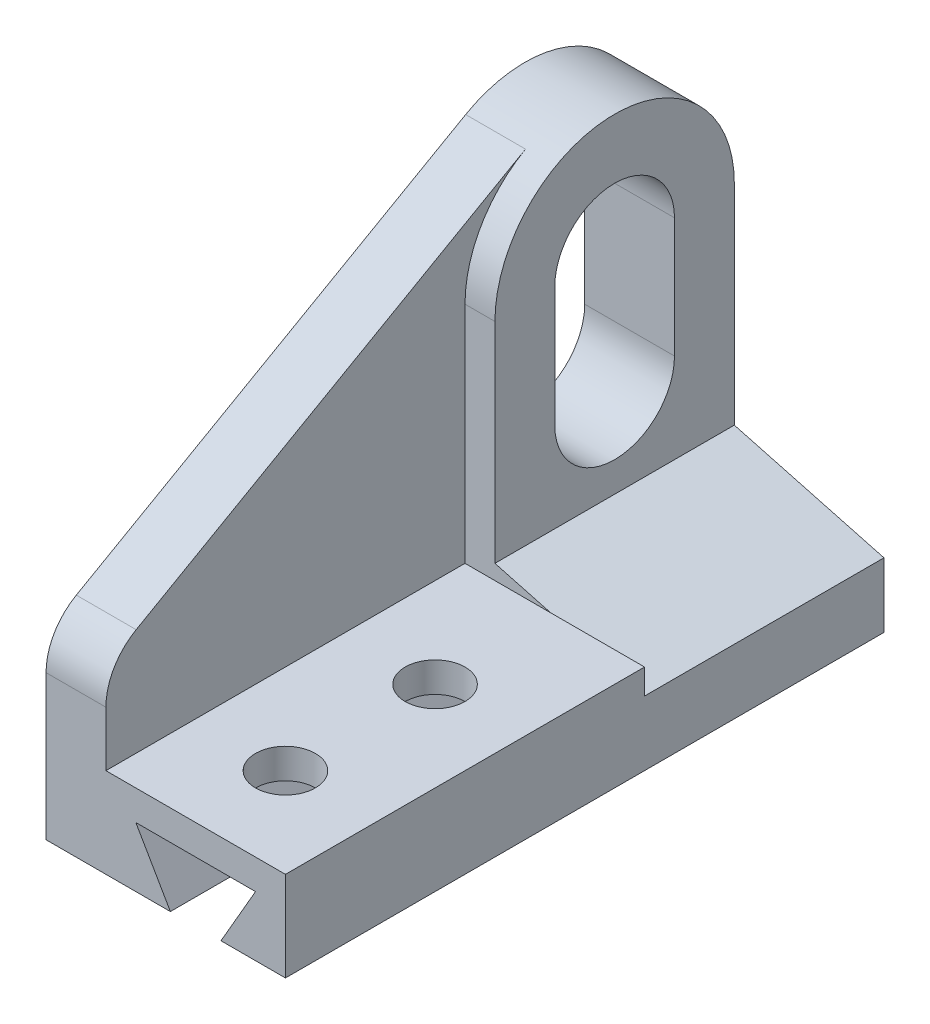
ISO-10303-21;
HEADER;
FILE_DESCRIPTION(('STEP AP214'),'2;1');
FILE_NAME('part.step','',(''),(''),'','','');
FILE_SCHEMA(('AUTOMOTIVE_DESIGN { 1 0 10303 214 1 1 1 1 }'));
ENDSEC;
DATA;
#1=APPLICATION_CONTEXT('core data for automotive mechanical design processes');
#2=APPLICATION_PROTOCOL_DEFINITION('international standard','automotive_design',2000,#1);
#3=PRODUCT_CONTEXT('',#1,'mechanical');
#4=PRODUCT('Part','Part','',(#3));
#5=PRODUCT_RELATED_PRODUCT_CATEGORY('part','',(#4));
#6=PRODUCT_DEFINITION_FORMATION('','',#4);
#7=PRODUCT_DEFINITION_CONTEXT('part definition',#1,'design');
#8=PRODUCT_DEFINITION('design','',#6,#7);
#9=PRODUCT_DEFINITION_SHAPE('','',#8);
#10=(LENGTH_UNIT() NAMED_UNIT(*) SI_UNIT(.MILLI.,.METRE.));
#11=(NAMED_UNIT(*) PLANE_ANGLE_UNIT() SI_UNIT($,.RADIAN.));
#12=(NAMED_UNIT(*) SI_UNIT($,.STERADIAN.) SOLID_ANGLE_UNIT());
#13=UNCERTAINTY_MEASURE_WITH_UNIT(LENGTH_MEASURE(1.E-05),#10,'distance_accuracy_value','');
#14=(GEOMETRIC_REPRESENTATION_CONTEXT(3) GLOBAL_UNCERTAINTY_ASSIGNED_CONTEXT((#13)) GLOBAL_UNIT_ASSIGNED_CONTEXT((#10,
#11,#12)) REPRESENTATION_CONTEXT('',''));
#15=CARTESIAN_POINT('',(0.,0.,0.));
#16=DIRECTION('',(0.,0.,1.));
#17=DIRECTION('',(1.,0.,0.));
#18=AXIS2_PLACEMENT_3D('',#15,#16,#17);
#19=CARTESIAN_POINT('',(12.7,0.,0.));
#20=DIRECTION('',(0.,0.,1.));
#21=DIRECTION('',(1.,0.,0.));
#22=AXIS2_PLACEMENT_3D('',#19,#20,#21);
#23=PLANE('',#22);
#24=DIRECTION('',(-1.,0.,0.));
#25=VECTOR('',#24,1.);
#26=CARTESIAN_POINT('',(44.45,12.7,0.));
#27=LINE('',#26,#25);
#28=CARTESIAN_POINT('',(44.45,12.7,0.));
#29=VERTEX_POINT('',#28);
#30=CARTESIAN_POINT('',(19.05,12.7,0.));
#31=VERTEX_POINT('',#30);
#32=EDGE_CURVE('E245',#29,#31,#27,.T.);
#33=ORIENTED_EDGE('',*,*,#32,.F.);
#34=DIRECTION('',(0.500000000000004,0.866025403784436,0.));
#35=VECTOR('',#34,1.);
#36=CARTESIAN_POINT('',(37.1176515812917,0.,0.));
#37=LINE('',#36,#35);
#38=CARTESIAN_POINT('',(37.1176515812917,0.,0.));
#39=VERTEX_POINT('',#38);
#40=EDGE_CURVE('E240',#39,#29,#37,.T.);
#41=ORIENTED_EDGE('',*,*,#40,.F.);
#42=DIRECTION('',(-1.,0.,0.));
#43=VECTOR('',#42,1.);
#44=CARTESIAN_POINT('',(12.7,0.,0.));
#45=LINE('',#44,#43);
#46=CARTESIAN_POINT('',(50.8,0.,0.));
#47=VERTEX_POINT('',#46);
#48=EDGE_CURVE('E365',#47,#39,#45,.T.);
#49=ORIENTED_EDGE('',*,*,#48,.F.);
#50=DIRECTION('',(0.,1.,0.));
#51=VECTOR('',#50,1.);
#52=CARTESIAN_POINT('',(50.8,0.,0.));
#53=LINE('',#52,#51);
#54=CARTESIAN_POINT('',(50.8,19.05,0.));
#55=VERTEX_POINT('',#54);
#56=EDGE_CURVE('E294',#47,#55,#53,.T.);
#57=ORIENTED_EDGE('',*,*,#56,.T.);
#58=DIRECTION('',(-1.,0.,0.));
#59=VECTOR('',#58,1.);
#60=CARTESIAN_POINT('',(50.8,19.05,0.));
#61=LINE('',#60,#59);
#62=CARTESIAN_POINT('',(12.7,19.05,0.));
#63=VERTEX_POINT('',#62);
#64=EDGE_CURVE('E300',#55,#63,#61,.T.);
#65=ORIENTED_EDGE('',*,*,#64,.T.);
#66=DIRECTION('',(0.,1.,0.));
#67=VECTOR('',#66,1.);
#68=CARTESIAN_POINT('',(12.7,0.,0.));
#69=LINE('',#68,#67);
#70=CARTESIAN_POINT('',(12.7,30.7135112138874,0.));
#71=VERTEX_POINT('',#70);
#72=EDGE_CURVE('E319',#63,#71,#69,.T.);
#73=ORIENTED_EDGE('',*,*,#72,.T.);
#74=DIRECTION('',(-1.,0.,0.));
#75=VECTOR('',#74,1.);
#76=CARTESIAN_POINT('',(12.7,30.7135112138874,0.));
#77=LINE('',#76,#75);
#78=CARTESIAN_POINT('',(0.,30.7135112138874,0.));
#79=VERTEX_POINT('',#78);
#80=EDGE_CURVE('E368',#71,#79,#77,.T.);
#81=ORIENTED_EDGE('',*,*,#80,.T.);
#82=DIRECTION('',(0.,1.,0.));
#83=VECTOR('',#82,1.);
#84=CARTESIAN_POINT('',(0.,0.,0.));
#85=LINE('',#84,#83);
#86=CARTESIAN_POINT('',(0.,0.,0.));
#87=VERTEX_POINT('',#86);
#88=EDGE_CURVE('E330',#87,#79,#85,.T.);
#89=ORIENTED_EDGE('',*,*,#88,.F.);
#90=CARTESIAN_POINT('',(26.3823484187083,0.,0.));
#91=VERTEX_POINT('',#90);
#92=EDGE_CURVE('E364',#91,#87,#45,.T.);
#93=ORIENTED_EDGE('',*,*,#92,.F.);
#94=DIRECTION('',(0.500000000000004,-0.866025403784436,0.));
#95=VECTOR('',#94,1.);
#96=CARTESIAN_POINT('',(19.05,12.7,0.));
#97=LINE('',#96,#95);
#98=EDGE_CURVE('E250',#31,#91,#97,.T.);
#99=ORIENTED_EDGE('',*,*,#98,.F.);
#100=EDGE_LOOP('',(#33,#41,#49,#57,#65,#73,#81,#89,#93,#99));
#101=FACE_BOUND('',#100,.T.);
#102=ADVANCED_FACE('F35',(#101),#23,.T.);
#103=CARTESIAN_POINT('',(12.7,0.,0.));
#104=DIRECTION('',(0.,1.,0.));
#105=DIRECTION('',(0.,0.,1.));
#106=AXIS2_PLACEMENT_3D('',#103,#104,#105);
#107=PLANE('',#106);
#108=DIRECTION('',(0.,0.,-1.));
#109=VECTOR('',#108,1.);
#110=CARTESIAN_POINT('',(37.1176515812917,0.,0.));
#111=LINE('',#110,#109);
#112=CARTESIAN_POINT('',(37.1176515812917,0.,-22.4427594229266));
#113=VERTEX_POINT('',#112);
#114=CARTESIAN_POINT('',(37.1176515812917,0.,-47.4072405770734));
#115=VERTEX_POINT('',#114);
#116=EDGE_CURVE('E264',#113,#115,#111,.T.);
#117=ORIENTED_EDGE('',*,*,#116,.T.);
#118=CARTESIAN_POINT('',(31.75,0.,-50.8));
#119=DIRECTION('',(0.,1.,0.));
#120=DIRECTION('',(0.,0.,1.));
#121=AXIS2_PLACEMENT_3D('',#118,#119,#120);
#122=CIRCLE('',#121,6.35);
#123=CARTESIAN_POINT('',(37.1176515812917,0.,-54.1927594229266));
#124=VERTEX_POINT('',#123);
#125=EDGE_CURVE('E49',#115,#124,#122,.T.);
#126=ORIENTED_EDGE('',*,*,#125,.T.);
#127=CARTESIAN_POINT('',(37.1176515812917,0.,-127.));
#128=VERTEX_POINT('',#127);
#129=EDGE_CURVE('E248',#124,#128,#111,.T.);
#130=ORIENTED_EDGE('',*,*,#129,.T.);
#131=DIRECTION('',(-1.,0.,0.));
#132=VECTOR('',#131,1.);
#133=CARTESIAN_POINT('',(12.7,0.,-127.));
#134=LINE('',#133,#132);
#135=CARTESIAN_POINT('',(50.8,0.,-127.));
#136=VERTEX_POINT('',#135);
#137=EDGE_CURVE('E361',#136,#128,#134,.T.);
#138=ORIENTED_EDGE('',*,*,#137,.F.);
#139=DIRECTION('',(0.,0.,-1.));
#140=VECTOR('',#139,1.);
#141=CARTESIAN_POINT('',(50.8,0.,0.));
#142=LINE('',#141,#140);
#143=EDGE_CURVE('E297',#47,#136,#142,.T.);
#144=ORIENTED_EDGE('',*,*,#143,.F.);
#145=ORIENTED_EDGE('',*,*,#48,.T.);
#146=CARTESIAN_POINT('',(37.1176515812917,0.,-15.6572405770734));
#147=VERTEX_POINT('',#146);
#148=EDGE_CURVE('E244',#39,#147,#111,.T.);
#149=ORIENTED_EDGE('',*,*,#148,.T.);
#150=CARTESIAN_POINT('',(31.75,0.,-19.05));
#151=DIRECTION('',(0.,1.,0.));
#152=DIRECTION('',(0.,0.,1.));
#153=AXIS2_PLACEMENT_3D('',#150,#151,#152);
#154=CIRCLE('',#153,6.35);
#155=EDGE_CURVE('E228',#147,#113,#154,.T.);
#156=ORIENTED_EDGE('',*,*,#155,.T.);
#157=EDGE_LOOP('',(#117,#126,#130,#138,#144,#145,#149,#156));
#158=FACE_BOUND('',#157,.T.);
#159=ADVANCED_FACE('F426',(#158),#107,.F.);
#160=DIRECTION('',(0.,0.,-1.));
#161=VECTOR('',#160,1.);
#162=CARTESIAN_POINT('',(26.3823484187083,0.,0.));
#163=LINE('',#162,#161);
#164=CARTESIAN_POINT('',(26.3823484187083,0.,-54.1927594229266));
#165=VERTEX_POINT('',#164);
#166=CARTESIAN_POINT('',(26.3823484187083,0.,-127.));
#167=VERTEX_POINT('',#166);
#168=EDGE_CURVE('E253',#165,#167,#163,.T.);
#169=ORIENTED_EDGE('',*,*,#168,.F.);
#170=CARTESIAN_POINT('',(26.3823484187083,0.,-47.4072405770734));
#171=VERTEX_POINT('',#170);
#172=EDGE_CURVE('E56',#165,#171,#122,.T.);
#173=ORIENTED_EDGE('',*,*,#172,.T.);
#174=CARTESIAN_POINT('',(26.3823484187083,0.,-22.4427594229266));
#175=VERTEX_POINT('',#174);
#176=EDGE_CURVE('E257',#175,#171,#163,.T.);
#177=ORIENTED_EDGE('',*,*,#176,.F.);
#178=CARTESIAN_POINT('',(26.3823484187083,0.,-15.6572405770734));
#179=VERTEX_POINT('',#178);
#180=EDGE_CURVE('E232',#175,#179,#154,.T.);
#181=ORIENTED_EDGE('',*,*,#180,.T.);
#182=EDGE_CURVE('E254',#91,#179,#163,.T.);
#183=ORIENTED_EDGE('',*,*,#182,.F.);
#184=ORIENTED_EDGE('',*,*,#92,.T.);
#185=DIRECTION('',(0.,0.,-1.));
#186=VECTOR('',#185,1.);
#187=CARTESIAN_POINT('',(0.,0.,0.));
#188=LINE('',#187,#186);
#189=CARTESIAN_POINT('',(0.,0.,-127.));
#190=VERTEX_POINT('',#189);
#191=EDGE_CURVE('E332',#87,#190,#188,.T.);
#192=ORIENTED_EDGE('',*,*,#191,.T.);
#193=EDGE_CURVE('E360',#167,#190,#134,.T.);
#194=ORIENTED_EDGE('',*,*,#193,.F.);
#195=EDGE_LOOP('',(#169,#173,#177,#181,#183,#184,#192,#194));
#196=FACE_BOUND('',#195,.T.);
#197=ADVANCED_FACE('F389',(#196),#107,.F.);
#198=CARTESIAN_POINT('',(12.7,0.,-127.));
#199=DIRECTION('',(0.,0.,1.));
#200=DIRECTION('',(1.,0.,0.));
#201=AXIS2_PLACEMENT_3D('',#198,#199,#200);
#202=PLANE('',#201);
#203=DIRECTION('',(0.,1.,0.));
#204=VECTOR('',#203,1.);
#205=CARTESIAN_POINT('',(19.05,0.,-127.));
#206=LINE('',#205,#204);
#207=CARTESIAN_POINT('',(19.05,22.225,-127.));
#208=VERTEX_POINT('',#207);
#209=CARTESIAN_POINT('',(19.05,66.675,-127.));
#210=VERTEX_POINT('',#209);
#211=EDGE_CURVE('E276',#208,#210,#206,.T.);
#212=ORIENTED_EDGE('',*,*,#211,.F.);
#213=DIRECTION('',(-0.965925826289067,0.258819045102525,0.));
#214=VECTOR('',#213,1.);
#215=CARTESIAN_POINT('',(19.05,22.225,-127.));
#216=LINE('',#215,#214);
#217=CARTESIAN_POINT('',(50.8,13.7176131403117,-127.));
#218=VERTEX_POINT('',#217);
#219=EDGE_CURVE('E220',#218,#208,#216,.T.);
#220=ORIENTED_EDGE('',*,*,#219,.F.);
#221=DIRECTION('',(0.,1.,0.));
#222=VECTOR('',#221,1.);
#223=CARTESIAN_POINT('',(50.8,0.,-127.));
#224=LINE('',#223,#222);
#225=EDGE_CURVE('E213',#136,#218,#224,.T.);
#226=ORIENTED_EDGE('',*,*,#225,.F.);
#227=ORIENTED_EDGE('',*,*,#137,.T.);
#228=DIRECTION('',(-0.500000000000004,-0.866025403784436,0.));
#229=VECTOR('',#228,1.);
#230=CARTESIAN_POINT('',(31.0132386859687,-10.573153285078,-127.));
#231=LINE('',#230,#229);
#232=CARTESIAN_POINT('',(44.45,12.7,-127.));
#233=VERTEX_POINT('',#232);
#234=EDGE_CURVE('E379',#233,#128,#231,.T.);
#235=ORIENTED_EDGE('',*,*,#234,.F.);
#236=DIRECTION('',(1.,0.,0.));
#237=VECTOR('',#236,1.);
#238=CARTESIAN_POINT('',(12.7,12.7,-127.));
#239=LINE('',#238,#237);
#240=CARTESIAN_POINT('',(19.05,12.7,-127.));
#241=VERTEX_POINT('',#240);
#242=EDGE_CURVE('E376',#241,#233,#239,.T.);
#243=ORIENTED_EDGE('',*,*,#242,.F.);
#244=DIRECTION('',(-0.500000000000004,0.866025403784436,0.));
#245=VECTOR('',#244,1.);
#246=CARTESIAN_POINT('',(22.9617613140312,5.92463065701566,-127.));
#247=LINE('',#246,#245);
#248=EDGE_CURVE('E357',#167,#241,#247,.T.);
#249=ORIENTED_EDGE('',*,*,#248,.F.);
#250=ORIENTED_EDGE('',*,*,#193,.T.);
#251=DIRECTION('',(0.,1.,0.));
#252=VECTOR('',#251,1.);
#253=CARTESIAN_POINT('',(0.,0.,-127.));
#254=LINE('',#253,#252);
#255=CARTESIAN_POINT('',(0.,66.675,-127.));
#256=VERTEX_POINT('',#255);
#257=EDGE_CURVE('E335',#190,#256,#254,.T.);
#258=ORIENTED_EDGE('',*,*,#257,.T.);
#259=DIRECTION('',(-1.,0.,0.));
#260=VECTOR('',#259,1.);
#261=CARTESIAN_POINT('',(12.7,66.675,-127.));
#262=LINE('',#261,#260);
#263=EDGE_CURVE('E321',#210,#256,#262,.T.);
#264=ORIENTED_EDGE('',*,*,#263,.F.);
#265=EDGE_LOOP('',(#212,#220,#226,#227,#235,#243,#249,#250,#258,#264));
#266=FACE_BOUND('',#265,.T.);
#267=ADVANCED_FACE('F398',(#266),#202,.F.);
#268=CARTESIAN_POINT('',(12.7,0.,0.));
#269=DIRECTION('',(1.,0.,0.));
#270=DIRECTION('',(0.,0.,-1.));
#271=AXIS2_PLACEMENT_3D('',#268,#269,#270);
#272=PLANE('',#271);
#273=DIRECTION('',(0.,-1.,0.));
#274=VECTOR('',#273,1.);
#275=CARTESIAN_POINT('',(12.7,0.,-76.2));
#276=LINE('',#275,#274);
#277=CARTESIAN_POINT('',(12.7,66.675,-76.2));
#278=VERTEX_POINT('',#277);
#279=CARTESIAN_POINT('',(12.7,19.05,-76.2));
#280=VERTEX_POINT('',#279);
#281=EDGE_CURVE('E308',#278,#280,#276,.T.);
#282=ORIENTED_EDGE('',*,*,#281,.F.);
#283=CARTESIAN_POINT('',(12.7,66.675,-101.6));
#284=DIRECTION('',(1.,0.,0.));
#285=DIRECTION('',(0.,0.,-1.));
#286=AXIS2_PLACEMENT_3D('',#283,#284,#285);
#287=CIRCLE('',#286,25.4);
#288=CARTESIAN_POINT('',(12.7,88.7526572782336,-89.0406588904968));
#289=VERTEX_POINT('',#288);
#290=EDGE_CURVE('E290',#278,#289,#287,.F.);
#291=ORIENTED_EDGE('',*,*,#290,.T.);
#292=DIRECTION('',(0.,0.494462248405638,-0.869199105442269));
#293=VECTOR('',#292,1.);
#294=CARTESIAN_POINT('',(12.7,28.7848199347525,16.3748520859868));
#295=LINE('',#294,#293);
#296=CARTESIAN_POINT('',(12.7,41.7523398530043,-6.42032944524839));
#297=VERTEX_POINT('',#296);
#298=EDGE_CURVE('E312',#297,#289,#295,.T.);
#299=ORIENTED_EDGE('',*,*,#298,.F.);
#300=CARTESIAN_POINT('',(12.7,30.7135112138874,-12.7));
#301=DIRECTION('',(1.,0.,0.));
#302=DIRECTION('',(0.,0.,-1.));
#303=AXIS2_PLACEMENT_3D('',#300,#301,#302);
#304=CIRCLE('',#303,12.7);
#305=EDGE_CURVE('E315',#71,#297,#304,.F.);
#306=ORIENTED_EDGE('',*,*,#305,.F.);
#307=ORIENTED_EDGE('',*,*,#72,.F.);
#308=DIRECTION('',(0.,0.,1.));
#309=VECTOR('',#308,1.);
#310=CARTESIAN_POINT('',(12.7,19.05,0.));
#311=LINE('',#310,#309);
#312=EDGE_CURVE('E305',#280,#63,#311,.T.);
#313=ORIENTED_EDGE('',*,*,#312,.F.);
#314=EDGE_LOOP('',(#282,#291,#299,#306,#307,#313));
#315=FACE_BOUND('',#314,.T.);
#316=ADVANCED_FACE('F443',(#315),#272,.T.);
#317=CARTESIAN_POINT('',(12.7,41.275,-101.6));
#318=DIRECTION('',(-1.,0.,0.));
#319=DIRECTION('',(0.,0.,1.));
#320=AXIS2_PLACEMENT_3D('',#317,#318,#319);
#321=CYLINDRICAL_SURFACE('',#320,12.7);
#322=CARTESIAN_POINT('',(0.,41.275,-101.6));
#323=DIRECTION('',(1.,0.,0.));
#324=DIRECTION('',(0.,0.,-1.));
#325=AXIS2_PLACEMENT_3D('',#322,#323,#324);
#326=CIRCLE('',#325,12.7);
#327=CARTESIAN_POINT('',(0.,41.275,-88.9));
#328=VERTEX_POINT('',#327);
#329=CARTESIAN_POINT('',(0.,41.275,-114.3));
#330=VERTEX_POINT('',#329);
#331=EDGE_CURVE('E337',#328,#330,#326,.T.);
#332=ORIENTED_EDGE('',*,*,#331,.F.);
#333=DIRECTION('',(-1.,0.,0.));
#334=VECTOR('',#333,1.);
#335=CARTESIAN_POINT('',(12.7,41.275,-88.9));
#336=LINE('',#335,#334);
#337=CARTESIAN_POINT('',(19.05,41.275,-88.9));
#338=VERTEX_POINT('',#337);
#339=EDGE_CURVE('E355',#338,#328,#336,.T.);
#340=ORIENTED_EDGE('',*,*,#339,.F.);
#341=CARTESIAN_POINT('',(19.05,41.275,-101.6));
#342=DIRECTION('',(1.,0.,0.));
#343=DIRECTION('',(0.,0.,-1.));
#344=AXIS2_PLACEMENT_3D('',#341,#342,#343);
#345=CIRCLE('',#344,12.7);
#346=CARTESIAN_POINT('',(19.05,41.275,-114.3));
#347=VERTEX_POINT('',#346);
#348=EDGE_CURVE('E243',#338,#347,#345,.T.);
#349=ORIENTED_EDGE('',*,*,#348,.T.);
#350=DIRECTION('',(-1.,0.,0.));
#351=VECTOR('',#350,1.);
#352=CARTESIAN_POINT('',(12.7,41.275,-114.3));
#353=LINE('',#352,#351);
#354=EDGE_CURVE('E348',#347,#330,#353,.T.);
#355=ORIENTED_EDGE('',*,*,#354,.T.);
#356=EDGE_LOOP('',(#332,#340,#349,#355));
#357=FACE_BOUND('',#356,.T.);
#358=ADVANCED_FACE('F445',(#357),#321,.F.);
#359=CARTESIAN_POINT('',(12.7,0.,-88.9));
#360=DIRECTION('',(0.,0.,1.));
#361=DIRECTION('',(1.,0.,0.));
#362=AXIS2_PLACEMENT_3D('',#359,#360,#361);
#363=PLANE('',#362);
#364=DIRECTION('',(0.,1.,0.));
#365=VECTOR('',#364,1.);
#366=CARTESIAN_POINT('',(0.,0.,-88.9));
#367=LINE('',#366,#365);
#368=CARTESIAN_POINT('',(0.,66.675,-88.9));
#369=VERTEX_POINT('',#368);
#370=EDGE_CURVE('E340',#328,#369,#367,.T.);
#371=ORIENTED_EDGE('',*,*,#370,.T.);
#372=DIRECTION('',(-1.,0.,0.));
#373=VECTOR('',#372,1.);
#374=CARTESIAN_POINT('',(12.7,66.675,-88.9));
#375=LINE('',#374,#373);
#376=CARTESIAN_POINT('',(19.05,66.675,-88.9));
#377=VERTEX_POINT('',#376);
#378=EDGE_CURVE('E353',#377,#369,#375,.T.);
#379=ORIENTED_EDGE('',*,*,#378,.F.);
#380=DIRECTION('',(0.,1.,0.));
#381=VECTOR('',#380,1.);
#382=CARTESIAN_POINT('',(19.05,0.,-88.9));
#383=LINE('',#382,#381);
#384=EDGE_CURVE('E267',#338,#377,#383,.T.);
#385=ORIENTED_EDGE('',*,*,#384,.F.);
#386=ORIENTED_EDGE('',*,*,#339,.T.);
#387=EDGE_LOOP('',(#371,#379,#385,#386));
#388=FACE_BOUND('',#387,.T.);
#389=ADVANCED_FACE('F451',(#388),#363,.F.);
#390=CARTESIAN_POINT('',(12.7,66.675,-101.6));
#391=DIRECTION('',(-1.,0.,0.));
#392=DIRECTION('',(0.,0.,1.));
#393=AXIS2_PLACEMENT_3D('',#390,#391,#392);
#394=CYLINDRICAL_SURFACE('',#393,12.7);
#395=CARTESIAN_POINT('',(0.,66.675,-101.6));
#396=DIRECTION('',(1.,0.,0.));
#397=DIRECTION('',(0.,0.,-1.));
#398=AXIS2_PLACEMENT_3D('',#395,#396,#397);
#399=CIRCLE('',#398,12.7);
#400=CARTESIAN_POINT('',(0.,66.675,-114.3));
#401=VERTEX_POINT('',#400);
#402=EDGE_CURVE('E343',#401,#369,#399,.T.);
#403=ORIENTED_EDGE('',*,*,#402,.F.);
#404=DIRECTION('',(-1.,0.,0.));
#405=VECTOR('',#404,1.);
#406=CARTESIAN_POINT('',(12.7,66.675,-114.3));
#407=LINE('',#406,#405);
#408=CARTESIAN_POINT('',(19.05,66.675,-114.3));
#409=VERTEX_POINT('',#408);
#410=EDGE_CURVE('E350',#409,#401,#407,.T.);
#411=ORIENTED_EDGE('',*,*,#410,.F.);
#412=CARTESIAN_POINT('',(19.05,66.675,-101.6));
#413=DIRECTION('',(1.,0.,0.));
#414=DIRECTION('',(0.,0.,-1.));
#415=AXIS2_PLACEMENT_3D('',#412,#413,#414);
#416=CIRCLE('',#415,12.7);
#417=EDGE_CURVE('E270',#409,#377,#416,.T.);
#418=ORIENTED_EDGE('',*,*,#417,.T.);
#419=ORIENTED_EDGE('',*,*,#378,.T.);
#420=EDGE_LOOP('',(#403,#411,#418,#419));
#421=FACE_BOUND('',#420,.T.);
#422=ADVANCED_FACE('F470',(#421),#394,.F.);
#423=CARTESIAN_POINT('',(12.7,66.675,-101.6));
#424=DIRECTION('',(-1.,0.,0.));
#425=DIRECTION('',(0.,0.,1.));
#426=AXIS2_PLACEMENT_3D('',#423,#424,#425);
#427=CYLINDRICAL_SURFACE('',#426,25.4);
#428=CARTESIAN_POINT('',(0.,66.675,-101.6));
#429=DIRECTION('',(1.,0.,0.));
#430=DIRECTION('',(0.,0.,-1.));
#431=AXIS2_PLACEMENT_3D('',#428,#429,#430);
#432=CIRCLE('',#431,25.4);
#433=CARTESIAN_POINT('',(0.,88.7526572782336,-89.0406588904968));
#434=VERTEX_POINT('',#433);
#435=EDGE_CURVE('E311',#256,#434,#432,.T.);
#436=ORIENTED_EDGE('',*,*,#435,.T.);
#437=DIRECTION('',(-1.,0.,0.));
#438=VECTOR('',#437,1.);
#439=CARTESIAN_POINT('',(12.7,88.7526572782336,-89.0406588904968));
#440=LINE('',#439,#438);
#441=EDGE_CURVE('E351',#289,#434,#440,.T.);
#442=ORIENTED_EDGE('',*,*,#441,.F.);
#443=ORIENTED_EDGE('',*,*,#290,.F.);
#444=DIRECTION('',(-1.,0.,0.));
#445=VECTOR('',#444,1.);
#446=CARTESIAN_POINT('',(19.05,66.675,-76.2));
#447=LINE('',#446,#445);
#448=CARTESIAN_POINT('',(19.05,66.675,-76.2));
#449=VERTEX_POINT('',#448);
#450=EDGE_CURVE('E287',#449,#278,#447,.T.);
#451=ORIENTED_EDGE('',*,*,#450,.F.);
#452=CARTESIAN_POINT('',(19.05,66.675,-101.6));
#453=DIRECTION('',(1.,0.,0.));
#454=DIRECTION('',(0.,0.,-1.));
#455=AXIS2_PLACEMENT_3D('',#452,#453,#454);
#456=CIRCLE('',#455,25.4);
#457=EDGE_CURVE('E279',#210,#449,#456,.T.);
#458=ORIENTED_EDGE('',*,*,#457,.F.);
#459=ORIENTED_EDGE('',*,*,#263,.T.);
#460=EDGE_LOOP('',(#436,#442,#443,#451,#458,#459));
#461=FACE_BOUND('',#460,.T.);
#462=ADVANCED_FACE('F37',(#461),#427,.T.);
#463=CARTESIAN_POINT('',(12.7,28.7848199347525,16.3748520859868));
#464=DIRECTION('',(0.,0.869199105442269,0.494462248405638));
#465=DIRECTION('',(0.,-0.494462248405638,0.869199105442269));
#466=AXIS2_PLACEMENT_3D('',#463,#464,#465);
#467=PLANE('',#466);
#468=DIRECTION('',(0.,0.494462248405638,-0.869199105442269));
#469=VECTOR('',#468,1.);
#470=CARTESIAN_POINT('',(0.,28.7848199347525,16.3748520859868));
#471=LINE('',#470,#469);
#472=CARTESIAN_POINT('',(0.,41.7523398530043,-6.42032944524839));
#473=VERTEX_POINT('',#472);
#474=EDGE_CURVE('E324',#473,#434,#471,.T.);
#475=ORIENTED_EDGE('',*,*,#474,.F.);
#476=DIRECTION('',(-1.,0.,0.));
#477=VECTOR('',#476,1.);
#478=CARTESIAN_POINT('',(12.7,41.7523398530043,-6.42032944524839));
#479=LINE('',#478,#477);
#480=EDGE_CURVE('E371',#297,#473,#479,.T.);
#481=ORIENTED_EDGE('',*,*,#480,.F.);
#482=ORIENTED_EDGE('',*,*,#298,.T.);
#483=ORIENTED_EDGE('',*,*,#441,.T.);
#484=EDGE_LOOP('',(#475,#481,#482,#483));
#485=FACE_BOUND('',#484,.T.);
#486=ADVANCED_FACE('F441',(#485),#467,.T.);
#487=CARTESIAN_POINT('',(12.7,30.7135112138874,-12.7));
#488=DIRECTION('',(-1.,0.,0.));
#489=DIRECTION('',(0.,0.,1.));
#490=AXIS2_PLACEMENT_3D('',#487,#488,#489);
#491=CYLINDRICAL_SURFACE('',#490,12.7);
#492=CARTESIAN_POINT('',(0.,30.7135112138874,-12.7));
#493=DIRECTION('',(1.,0.,0.));
#494=DIRECTION('',(0.,0.,-1.));
#495=AXIS2_PLACEMENT_3D('',#492,#493,#494);
#496=CIRCLE('',#495,12.7);
#497=EDGE_CURVE('E327',#79,#473,#496,.F.);
#498=ORIENTED_EDGE('',*,*,#497,.F.);
#499=ORIENTED_EDGE('',*,*,#80,.F.);
#500=ORIENTED_EDGE('',*,*,#305,.T.);
#501=ORIENTED_EDGE('',*,*,#480,.T.);
#502=EDGE_LOOP('',(#498,#499,#500,#501));
#503=FACE_BOUND('',#502,.T.);
#504=ADVANCED_FACE('F437',(#503),#491,.T.);
#505=CARTESIAN_POINT('',(12.7,0.,-114.3));
#506=DIRECTION('',(0.,0.,-1.));
#507=DIRECTION('',(-1.,0.,0.));
#508=AXIS2_PLACEMENT_3D('',#505,#506,#507);
#509=PLANE('',#508);
#510=DIRECTION('',(0.,-1.,0.));
#511=VECTOR('',#510,1.);
#512=CARTESIAN_POINT('',(0.,0.,-114.3));
#513=LINE('',#512,#511);
#514=EDGE_CURVE('E316',#401,#330,#513,.T.);
#515=ORIENTED_EDGE('',*,*,#514,.T.);
#516=ORIENTED_EDGE('',*,*,#354,.F.);
#517=DIRECTION('',(0.,-1.,0.));
#518=VECTOR('',#517,1.);
#519=CARTESIAN_POINT('',(19.05,0.,-114.3));
#520=LINE('',#519,#518);
#521=EDGE_CURVE('E273',#409,#347,#520,.T.);
#522=ORIENTED_EDGE('',*,*,#521,.F.);
#523=ORIENTED_EDGE('',*,*,#410,.T.);
#524=EDGE_LOOP('',(#515,#516,#522,#523));
#525=FACE_BOUND('',#524,.T.);
#526=ADVANCED_FACE('F465',(#525),#509,.F.);
#527=CARTESIAN_POINT('',(0.,0.,0.));
#528=DIRECTION('',(1.,0.,0.));
#529=DIRECTION('',(0.,0.,-1.));
#530=AXIS2_PLACEMENT_3D('',#527,#528,#529);
#531=PLANE('',#530);
#532=ORIENTED_EDGE('',*,*,#474,.T.);
#533=ORIENTED_EDGE('',*,*,#435,.F.);
#534=ORIENTED_EDGE('',*,*,#257,.F.);
#535=ORIENTED_EDGE('',*,*,#191,.F.);
#536=ORIENTED_EDGE('',*,*,#88,.T.);
#537=ORIENTED_EDGE('',*,*,#497,.T.);
#538=EDGE_LOOP('',(#532,#533,#534,#535,#536,#537));
#539=FACE_BOUND('',#538,.T.);
#540=ORIENTED_EDGE('',*,*,#331,.T.);
#541=ORIENTED_EDGE('',*,*,#514,.F.);
#542=ORIENTED_EDGE('',*,*,#402,.T.);
#543=ORIENTED_EDGE('',*,*,#370,.F.);
#544=EDGE_LOOP('',(#540,#541,#542,#543));
#545=FACE_BOUND('',#544,.T.);
#546=ADVANCED_FACE('F405',(#539,#545),#531,.F.);
#547=CARTESIAN_POINT('',(50.8,0.,-76.2));
#548=DIRECTION('',(0.,0.,1.));
#549=DIRECTION('',(1.,0.,0.));
#550=AXIS2_PLACEMENT_3D('',#547,#548,#549);
#551=PLANE('',#550);
#552=DIRECTION('',(-0.965925826289067,0.258819045102525,0.));
#553=VECTOR('',#552,1.);
#554=CARTESIAN_POINT('',(19.05,22.225,-76.2));
#555=LINE('',#554,#553);
#556=CARTESIAN_POINT('',(30.899261314031,19.05,-76.2));
#557=VERTEX_POINT('',#556);
#558=CARTESIAN_POINT('',(19.05,22.225,-76.2));
#559=VERTEX_POINT('',#558);
#560=EDGE_CURVE('E207',#557,#559,#555,.T.);
#561=ORIENTED_EDGE('',*,*,#560,.T.);
#562=DIRECTION('',(0.,1.,0.));
#563=VECTOR('',#562,1.);
#564=CARTESIAN_POINT('',(19.05,0.,-76.2));
#565=LINE('',#564,#563);
#566=EDGE_CURVE('E281',#559,#449,#565,.T.);
#567=ORIENTED_EDGE('',*,*,#566,.T.);
#568=ORIENTED_EDGE('',*,*,#450,.T.);
#569=ORIENTED_EDGE('',*,*,#281,.T.);
#570=DIRECTION('',(-1.,0.,0.));
#571=VECTOR('',#570,1.);
#572=CARTESIAN_POINT('',(50.8,19.05,-76.2));
#573=LINE('',#572,#571);
#574=EDGE_CURVE('E303',#557,#280,#573,.T.);
#575=ORIENTED_EDGE('',*,*,#574,.F.);
#576=EDGE_LOOP('',(#561,#567,#568,#569,#575));
#577=FACE_BOUND('',#576,.T.);
#578=ADVANCED_FACE('F416',(#577),#551,.T.);
#579=CARTESIAN_POINT('',(50.8,19.05,0.));
#580=DIRECTION('',(0.,1.,0.));
#581=DIRECTION('',(0.,0.,1.));
#582=AXIS2_PLACEMENT_3D('',#579,#580,#581);
#583=PLANE('',#582);
#584=CARTESIAN_POINT('',(31.75,19.05,-50.8));
#585=DIRECTION('',(0.,1.,0.));
#586=DIRECTION('',(0.,0.,1.));
#587=AXIS2_PLACEMENT_3D('',#584,#585,#586);
#588=CIRCLE('',#587,6.35);
#589=CARTESIAN_POINT('',(31.75,19.05,-44.45));
#590=VERTEX_POINT('',#589);
#591=EDGE_CURVE('E214',#590,#590,#588,.T.);
#592=ORIENTED_EDGE('',*,*,#591,.F.);
#593=EDGE_LOOP('',(#592));
#594=FACE_BOUND('',#593,.T.);
#595=CARTESIAN_POINT('',(31.75,19.05,-19.05));
#596=DIRECTION('',(0.,1.,0.));
#597=DIRECTION('',(0.,0.,1.));
#598=AXIS2_PLACEMENT_3D('',#595,#596,#597);
#599=CIRCLE('',#598,6.35);
#600=CARTESIAN_POINT('',(31.75,19.05,-12.7));
#601=VERTEX_POINT('',#600);
#602=EDGE_CURVE('E227',#601,#601,#599,.T.);
#603=ORIENTED_EDGE('',*,*,#602,.F.);
#604=EDGE_LOOP('',(#603));
#605=FACE_BOUND('',#604,.T.);
#606=CARTESIAN_POINT('',(50.8,19.05,-76.2));
#607=VERTEX_POINT('',#606);
#608=EDGE_CURVE('E197',#607,#557,#573,.T.);
#609=ORIENTED_EDGE('',*,*,#608,.T.);
#610=ORIENTED_EDGE('',*,*,#574,.T.);
#611=ORIENTED_EDGE('',*,*,#312,.T.);
#612=ORIENTED_EDGE('',*,*,#64,.F.);
#613=DIRECTION('',(0.,0.,-1.));
#614=VECTOR('',#613,1.);
#615=CARTESIAN_POINT('',(50.8,19.05,0.));
#616=LINE('',#615,#614);
#617=EDGE_CURVE('E292',#55,#607,#616,.T.);
#618=ORIENTED_EDGE('',*,*,#617,.T.);
#619=EDGE_LOOP('',(#609,#610,#611,#612,#618));
#620=FACE_BOUND('',#619,.T.);
#621=ADVANCED_FACE('F419',(#594,#605,#620),#583,.T.);
#622=CARTESIAN_POINT('',(50.8,0.,0.));
#623=DIRECTION('',(1.,0.,0.));
#624=DIRECTION('',(0.,0.,-1.));
#625=AXIS2_PLACEMENT_3D('',#622,#623,#624);
#626=PLANE('',#625);
#627=DIRECTION('',(0.,0.,-1.));
#628=VECTOR('',#627,1.);
#629=CARTESIAN_POINT('',(50.8,13.7176131403117,-76.2));
#630=LINE('',#629,#628);
#631=CARTESIAN_POINT('',(50.8,13.7176131403117,-76.2));
#632=VERTEX_POINT('',#631);
#633=EDGE_CURVE('E204',#632,#218,#630,.T.);
#634=ORIENTED_EDGE('',*,*,#633,.F.);
#635=DIRECTION('',(0.,1.,0.));
#636=VECTOR('',#635,1.);
#637=CARTESIAN_POINT('',(50.8,0.,-76.2));
#638=LINE('',#637,#636);
#639=EDGE_CURVE('E11',#632,#607,#638,.T.);
#640=ORIENTED_EDGE('',*,*,#639,.T.);
#641=ORIENTED_EDGE('',*,*,#617,.F.);
#642=ORIENTED_EDGE('',*,*,#56,.F.);
#643=ORIENTED_EDGE('',*,*,#143,.T.);
#644=ORIENTED_EDGE('',*,*,#225,.T.);
#645=EDGE_LOOP('',(#634,#640,#641,#642,#643,#644));
#646=FACE_BOUND('',#645,.T.);
#647=ADVANCED_FACE('F210',(#646),#626,.T.);
#648=CARTESIAN_POINT('',(19.05,0.,0.));
#649=DIRECTION('',(1.,0.,0.));
#650=DIRECTION('',(0.,0.,-1.));
#651=AXIS2_PLACEMENT_3D('',#648,#649,#650);
#652=PLANE('',#651);
#653=ORIENTED_EDGE('',*,*,#348,.F.);
#654=ORIENTED_EDGE('',*,*,#384,.T.);
#655=ORIENTED_EDGE('',*,*,#417,.F.);
#656=ORIENTED_EDGE('',*,*,#521,.T.);
#657=EDGE_LOOP('',(#653,#654,#655,#656));
#658=FACE_BOUND('',#657,.T.);
#659=ORIENTED_EDGE('',*,*,#211,.T.);
#660=ORIENTED_EDGE('',*,*,#457,.T.);
#661=ORIENTED_EDGE('',*,*,#566,.F.);
#662=DIRECTION('',(0.,0.,-1.));
#663=VECTOR('',#662,1.);
#664=CARTESIAN_POINT('',(19.05,22.225,0.));
#665=LINE('',#664,#663);
#666=EDGE_CURVE('E284',#559,#208,#665,.T.);
#667=ORIENTED_EDGE('',*,*,#666,.T.);
#668=EDGE_LOOP('',(#659,#660,#661,#667));
#669=FACE_BOUND('',#668,.T.);
#670=ADVANCED_FACE('F414',(#658,#669),#652,.T.);
#671=CARTESIAN_POINT('',(37.1176515812917,0.,0.));
#672=DIRECTION('',(-0.866025403784436,0.500000000000004,0.));
#673=DIRECTION('',(-0.500000000000004,-0.866025403784436,0.));
#674=AXIS2_PLACEMENT_3D('',#671,#672,#673);
#675=PLANE('',#674);
#676=CARTESIAN_POINT('',(31.75,-9.2970452561245,-50.8));
#677=DIRECTION('',(-0.866025403784436,0.500000000000004,0.));
#678=DIRECTION('',(0.500000000000004,0.866025403784436,0.));
#679=AXIS2_PLACEMENT_3D('',#676,#677,#678);
#680=ELLIPSE('',#679,12.6999999999999,6.35);
#681=EDGE_CURVE('E225',#115,#124,#680,.T.);
#682=ORIENTED_EDGE('',*,*,#681,.F.);
#683=ORIENTED_EDGE('',*,*,#116,.F.);
#684=CARTESIAN_POINT('',(31.75,-9.2970452561245,-19.05));
#685=DIRECTION('',(-0.866025403784436,0.500000000000004,0.));
#686=DIRECTION('',(0.500000000000004,0.866025403784436,0.));
#687=AXIS2_PLACEMENT_3D('',#684,#685,#686);
#688=ELLIPSE('',#687,12.6999999999999,6.35);
#689=EDGE_CURVE('E237',#147,#113,#688,.T.);
#690=ORIENTED_EDGE('',*,*,#689,.F.);
#691=ORIENTED_EDGE('',*,*,#148,.F.);
#692=ORIENTED_EDGE('',*,*,#40,.T.);
#693=DIRECTION('',(0.,0.,-1.));
#694=VECTOR('',#693,1.);
#695=CARTESIAN_POINT('',(44.45,12.7,0.));
#696=LINE('',#695,#694);
#697=EDGE_CURVE('E249',#29,#233,#696,.T.);
#698=ORIENTED_EDGE('',*,*,#697,.T.);
#699=ORIENTED_EDGE('',*,*,#234,.T.);
#700=ORIENTED_EDGE('',*,*,#129,.F.);
#701=EDGE_LOOP('',(#682,#683,#690,#691,#692,#698,#699,#700));
#702=FACE_BOUND('',#701,.T.);
#703=ADVANCED_FACE('F429',(#702),#675,.T.);
#704=CARTESIAN_POINT('',(44.45,12.7,0.));
#705=DIRECTION('',(0.,-1.,0.));
#706=DIRECTION('',(1.,0.,0.));
#707=AXIS2_PLACEMENT_3D('',#704,#705,#706);
#708=PLANE('',#707);
#709=CARTESIAN_POINT('',(31.75,12.7,-50.8));
#710=DIRECTION('',(0.,-1.,0.));
#711=DIRECTION('',(1.,0.,0.));
#712=AXIS2_PLACEMENT_3D('',#709,#710,#711);
#713=CIRCLE('',#712,6.35);
#714=CARTESIAN_POINT('',(31.75,12.7,-44.45));
#715=VERTEX_POINT('',#714);
#716=EDGE_CURVE('E221',#715,#715,#713,.T.);
#717=ORIENTED_EDGE('',*,*,#716,.F.);
#718=EDGE_LOOP('',(#717));
#719=FACE_BOUND('',#718,.T.);
#720=CARTESIAN_POINT('',(31.75,12.7,-19.05));
#721=DIRECTION('',(0.,-1.,0.));
#722=DIRECTION('',(1.,0.,0.));
#723=AXIS2_PLACEMENT_3D('',#720,#721,#722);
#724=CIRCLE('',#723,6.35);
#725=CARTESIAN_POINT('',(31.75,12.7,-12.7));
#726=VERTEX_POINT('',#725);
#727=EDGE_CURVE('E231',#726,#726,#724,.T.);
#728=ORIENTED_EDGE('',*,*,#727,.F.);
#729=EDGE_LOOP('',(#728));
#730=FACE_BOUND('',#729,.T.);
#731=DIRECTION('',(0.,0.,-1.));
#732=VECTOR('',#731,1.);
#733=CARTESIAN_POINT('',(19.05,12.7,0.));
#734=LINE('',#733,#732);
#735=EDGE_CURVE('E239',#31,#241,#734,.T.);
#736=ORIENTED_EDGE('',*,*,#735,.T.);
#737=ORIENTED_EDGE('',*,*,#242,.T.);
#738=ORIENTED_EDGE('',*,*,#697,.F.);
#739=ORIENTED_EDGE('',*,*,#32,.T.);
#740=EDGE_LOOP('',(#736,#737,#738,#739));
#741=FACE_BOUND('',#740,.T.);
#742=ADVANCED_FACE('F432',(#719,#730,#741),#708,.T.);
#743=CARTESIAN_POINT('',(19.05,12.7,0.));
#744=DIRECTION('',(0.866025403784436,0.500000000000004,0.));
#745=DIRECTION('',(-0.500000000000004,0.866025403784436,0.));
#746=AXIS2_PLACEMENT_3D('',#743,#744,#745);
#747=PLANE('',#746);
#748=CARTESIAN_POINT('',(31.75,-9.29704525612449,-50.8));
#749=DIRECTION('',(0.866025403784436,0.500000000000004,0.));
#750=DIRECTION('',(-0.500000000000004,0.866025403784436,0.));
#751=AXIS2_PLACEMENT_3D('',#748,#749,#750);
#752=ELLIPSE('',#751,12.6999999999999,6.35);
#753=EDGE_CURVE('E43',#165,#171,#752,.T.);
#754=ORIENTED_EDGE('',*,*,#753,.F.);
#755=ORIENTED_EDGE('',*,*,#168,.T.);
#756=ORIENTED_EDGE('',*,*,#248,.T.);
#757=ORIENTED_EDGE('',*,*,#735,.F.);
#758=ORIENTED_EDGE('',*,*,#98,.T.);
#759=ORIENTED_EDGE('',*,*,#182,.T.);
#760=CARTESIAN_POINT('',(31.75,-9.29704525612449,-19.05));
#761=DIRECTION('',(0.866025403784436,0.500000000000004,0.));
#762=DIRECTION('',(-0.500000000000004,0.866025403784436,0.));
#763=AXIS2_PLACEMENT_3D('',#760,#761,#762);
#764=ELLIPSE('',#763,12.6999999999999,6.35);
#765=EDGE_CURVE('E382',#175,#179,#764,.T.);
#766=ORIENTED_EDGE('',*,*,#765,.F.);
#767=ORIENTED_EDGE('',*,*,#176,.T.);
#768=EDGE_LOOP('',(#754,#755,#756,#757,#758,#759,#766,#767));
#769=FACE_BOUND('',#768,.T.);
#770=ADVANCED_FACE('F393',(#769),#747,.T.);
#771=CARTESIAN_POINT('',(31.75,0.,-19.05));
#772=DIRECTION('',(0.,1.,0.));
#773=DIRECTION('',(0.,0.,1.));
#774=AXIS2_PLACEMENT_3D('',#771,#772,#773);
#775=CYLINDRICAL_SURFACE('',#774,6.35);
#776=ORIENTED_EDGE('',*,*,#765,.T.);
#777=ORIENTED_EDGE('',*,*,#180,.F.);
#778=EDGE_LOOP('',(#776,#777));
#779=FACE_BOUND('',#778,.T.);
#780=ADVANCED_FACE('F507',(#779),#775,.F.);
#781=CARTESIAN_POINT('',(31.75,12.7,-12.7));
#782=CARTESIAN_POINT('',(31.75,12.7661458333333,-12.7));
#783=CARTESIAN_POINT('',(31.75,12.8322916666667,-12.7));
#784=CARTESIAN_POINT('',(31.75,12.9645833333333,-12.7));
#785=CARTESIAN_POINT('',(31.75,13.0307291666667,-12.7));
#786=CARTESIAN_POINT('',(31.75,13.1630208333333,-12.7));
#787=CARTESIAN_POINT('',(31.75,13.2291666666667,-12.7));
#788=CARTESIAN_POINT('',(31.75,13.3614583333333,-12.7));
#789=CARTESIAN_POINT('',(31.75,13.4276041666667,-12.7));
#790=CARTESIAN_POINT('',(31.75,13.5598958333333,-12.7));
#791=CARTESIAN_POINT('',(31.75,13.6260416666667,-12.7));
#792=CARTESIAN_POINT('',(31.75,13.7583333333333,-12.7));
#793=CARTESIAN_POINT('',(31.75,13.8244791666667,-12.7));
#794=CARTESIAN_POINT('',(31.75,13.9567708333333,-12.7));
#795=CARTESIAN_POINT('',(31.75,14.0229166666667,-12.7));
#796=CARTESIAN_POINT('',(31.75,14.1552083333333,-12.7));
#797=CARTESIAN_POINT('',(31.75,14.2213541666667,-12.7));
#798=CARTESIAN_POINT('',(31.75,14.3536458333333,-12.7));
#799=CARTESIAN_POINT('',(31.75,14.4197916666667,-12.7));
#800=CARTESIAN_POINT('',(31.75,14.5520833333333,-12.7));
#801=CARTESIAN_POINT('',(31.75,14.6182291666667,-12.7));
#802=CARTESIAN_POINT('',(31.75,14.7505208333333,-12.7));
#803=CARTESIAN_POINT('',(31.75,14.8166666666667,-12.7));
#804=CARTESIAN_POINT('',(31.75,14.9489583333333,-12.7));
#805=CARTESIAN_POINT('',(31.75,15.0151041666667,-12.7));
#806=CARTESIAN_POINT('',(31.75,15.1473958333333,-12.7));
#807=CARTESIAN_POINT('',(31.75,15.2135416666667,-12.7));
#808=CARTESIAN_POINT('',(31.75,15.3458333333333,-12.7));
#809=CARTESIAN_POINT('',(31.75,15.4119791666667,-12.7));
#810=CARTESIAN_POINT('',(31.75,15.5442708333333,-12.7));
#811=CARTESIAN_POINT('',(31.75,15.6104166666667,-12.7));
#812=CARTESIAN_POINT('',(31.75,15.7427083333333,-12.7));
#813=CARTESIAN_POINT('',(31.75,15.8088541666667,-12.7));
#814=CARTESIAN_POINT('',(31.75,15.9411458333333,-12.7));
#815=CARTESIAN_POINT('',(31.75,16.0072916666667,-12.7));
#816=CARTESIAN_POINT('',(31.75,16.1395833333333,-12.7));
#817=CARTESIAN_POINT('',(31.75,16.2057291666667,-12.7));
#818=CARTESIAN_POINT('',(31.75,16.3380208333333,-12.7));
#819=CARTESIAN_POINT('',(31.75,16.4041666666667,-12.7));
#820=CARTESIAN_POINT('',(31.75,16.5364583333333,-12.7));
#821=CARTESIAN_POINT('',(31.75,16.6026041666667,-12.7));
#822=CARTESIAN_POINT('',(31.75,16.7348958333333,-12.7));
#823=CARTESIAN_POINT('',(31.75,16.8010416666667,-12.7));
#824=CARTESIAN_POINT('',(31.75,16.9333333333333,-12.7));
#825=CARTESIAN_POINT('',(31.75,16.9994791666667,-12.7));
#826=CARTESIAN_POINT('',(31.75,17.1317708333333,-12.7));
#827=CARTESIAN_POINT('',(31.75,17.1979166666667,-12.7));
#828=CARTESIAN_POINT('',(31.75,17.3302083333333,-12.7));
#829=CARTESIAN_POINT('',(31.75,17.3963541666667,-12.7));
#830=CARTESIAN_POINT('',(31.75,17.5286458333333,-12.7));
#831=CARTESIAN_POINT('',(31.75,17.5947916666667,-12.7));
#832=CARTESIAN_POINT('',(31.75,17.7270833333333,-12.7));
#833=CARTESIAN_POINT('',(31.75,17.7932291666667,-12.7));
#834=CARTESIAN_POINT('',(31.75,17.9255208333333,-12.7));
#835=CARTESIAN_POINT('',(31.75,17.9916666666667,-12.7));
#836=CARTESIAN_POINT('',(31.75,18.1239583333333,-12.7));
#837=CARTESIAN_POINT('',(31.75,18.1901041666667,-12.7));
#838=CARTESIAN_POINT('',(31.75,18.3223958333333,-12.7));
#839=CARTESIAN_POINT('',(31.75,18.3885416666667,-12.7));
#840=CARTESIAN_POINT('',(31.75,18.5208333333333,-12.7));
#841=CARTESIAN_POINT('',(31.75,18.5869791666667,-12.7));
#842=CARTESIAN_POINT('',(31.75,18.7192708333333,-12.7));
#843=CARTESIAN_POINT('',(31.75,18.7854166666667,-12.7));
#844=CARTESIAN_POINT('',(31.75,18.9177083333333,-12.7));
#845=CARTESIAN_POINT('',(31.75,18.9838541666667,-12.7));
#846=CARTESIAN_POINT('',(31.75,19.05,-12.7));
#847=B_SPLINE_CURVE_WITH_KNOTS('',3,(#781,#782,#783,#784,#785,#786,#787,#788,#789,#790,#791,
#792,#793,#794,#795,#796,#797,#798,#799,#800,#801,#802,#803,#804,#805,#806,#807,#808,#809,#810,
#811,#812,#813,#814,#815,#816,#817,#818,#819,#820,#821,#822,#823,#824,#825,#826,#827,#828,#829,
#830,#831,#832,#833,#834,#835,#836,#837,#838,#839,#840,#841,#842,#843,#844,#845,#846),
.UNSPECIFIED.,.F.,.F.,(4,2,2,2,2,2,2,2,2,2,2,2,2,2,2,2,2,2,2,2,2,2,2,2,2,2,2,2,2,2,2,2,4),(0.,
0.198437500000001,0.396875,0.5953125,0.793750000000001,0.992187500000002,1.190625,1.3890625,
1.5875,1.7859375,1.984375,2.1828125,2.38125,2.5796875,2.778125,2.9765625,3.175,3.3734375,
3.571875,3.7703125,3.96875,4.1671875,4.365625,4.5640625,4.7625,4.9609375,5.159375,5.3578125,
5.55625,5.7546875,5.953125,6.1515625,6.35),.UNSPECIFIED.);
#848=EDGE_CURVE('BSEAM510',#726,#601,#847,.T.);
#849=ORIENTED_EDGE('',*,*,#727,.T.);
#850=ORIENTED_EDGE('',*,*,#602,.T.);
#851=ORIENTED_EDGE('',*,*,#848,.T.);
#852=ORIENTED_EDGE('',*,*,#848,.F.);
#853=EDGE_LOOP('',(#849,#851,#850,#852));
#854=FACE_BOUND('',#853,.T.);
#855=ADVANCED_FACE('F510',(#854),#775,.F.);
#856=ORIENTED_EDGE('',*,*,#689,.T.);
#857=ORIENTED_EDGE('',*,*,#155,.F.);
#858=EDGE_LOOP('',(#856,#857));
#859=FACE_BOUND('',#858,.T.);
#860=ADVANCED_FACE('F512',(#859),#775,.F.);
#861=CARTESIAN_POINT('',(31.75,0.,-50.8));
#862=DIRECTION('',(0.,1.,0.));
#863=DIRECTION('',(0.,0.,1.));
#864=AXIS2_PLACEMENT_3D('',#861,#862,#863);
#865=CYLINDRICAL_SURFACE('',#864,6.35);
#866=ORIENTED_EDGE('',*,*,#753,.T.);
#867=ORIENTED_EDGE('',*,*,#172,.F.);
#868=EDGE_LOOP('',(#866,#867));
#869=FACE_BOUND('',#868,.T.);
#870=ADVANCED_FACE('F383',(#869),#865,.F.);
#871=CARTESIAN_POINT('',(31.75,12.7,-44.45));
#872=CARTESIAN_POINT('',(31.75,12.7661458333333,-44.45));
#873=CARTESIAN_POINT('',(31.75,12.8322916666667,-44.45));
#874=CARTESIAN_POINT('',(31.75,12.9645833333333,-44.45));
#875=CARTESIAN_POINT('',(31.75,13.0307291666667,-44.45));
#876=CARTESIAN_POINT('',(31.75,13.1630208333333,-44.45));
#877=CARTESIAN_POINT('',(31.75,13.2291666666667,-44.45));
#878=CARTESIAN_POINT('',(31.75,13.3614583333333,-44.45));
#879=CARTESIAN_POINT('',(31.75,13.4276041666667,-44.45));
#880=CARTESIAN_POINT('',(31.75,13.5598958333333,-44.45));
#881=CARTESIAN_POINT('',(31.75,13.6260416666667,-44.45));
#882=CARTESIAN_POINT('',(31.75,13.7583333333333,-44.45));
#883=CARTESIAN_POINT('',(31.75,13.8244791666667,-44.45));
#884=CARTESIAN_POINT('',(31.75,13.9567708333333,-44.45));
#885=CARTESIAN_POINT('',(31.75,14.0229166666667,-44.45));
#886=CARTESIAN_POINT('',(31.75,14.1552083333333,-44.45));
#887=CARTESIAN_POINT('',(31.75,14.2213541666667,-44.45));
#888=CARTESIAN_POINT('',(31.75,14.3536458333333,-44.45));
#889=CARTESIAN_POINT('',(31.75,14.4197916666667,-44.45));
#890=CARTESIAN_POINT('',(31.75,14.5520833333333,-44.45));
#891=CARTESIAN_POINT('',(31.75,14.6182291666667,-44.45));
#892=CARTESIAN_POINT('',(31.75,14.7505208333333,-44.45));
#893=CARTESIAN_POINT('',(31.75,14.8166666666667,-44.45));
#894=CARTESIAN_POINT('',(31.75,14.9489583333333,-44.45));
#895=CARTESIAN_POINT('',(31.75,15.0151041666667,-44.45));
#896=CARTESIAN_POINT('',(31.75,15.1473958333333,-44.45));
#897=CARTESIAN_POINT('',(31.75,15.2135416666667,-44.45));
#898=CARTESIAN_POINT('',(31.75,15.3458333333333,-44.45));
#899=CARTESIAN_POINT('',(31.75,15.4119791666667,-44.45));
#900=CARTESIAN_POINT('',(31.75,15.5442708333333,-44.45));
#901=CARTESIAN_POINT('',(31.75,15.6104166666667,-44.45));
#902=CARTESIAN_POINT('',(31.75,15.7427083333333,-44.45));
#903=CARTESIAN_POINT('',(31.75,15.8088541666667,-44.45));
#904=CARTESIAN_POINT('',(31.75,15.9411458333333,-44.45));
#905=CARTESIAN_POINT('',(31.75,16.0072916666667,-44.45));
#906=CARTESIAN_POINT('',(31.75,16.1395833333333,-44.45));
#907=CARTESIAN_POINT('',(31.75,16.2057291666667,-44.45));
#908=CARTESIAN_POINT('',(31.75,16.3380208333333,-44.45));
#909=CARTESIAN_POINT('',(31.75,16.4041666666667,-44.45));
#910=CARTESIAN_POINT('',(31.75,16.5364583333333,-44.45));
#911=CARTESIAN_POINT('',(31.75,16.6026041666667,-44.45));
#912=CARTESIAN_POINT('',(31.75,16.7348958333333,-44.45));
#913=CARTESIAN_POINT('',(31.75,16.8010416666667,-44.45));
#914=CARTESIAN_POINT('',(31.75,16.9333333333333,-44.45));
#915=CARTESIAN_POINT('',(31.75,16.9994791666667,-44.45));
#916=CARTESIAN_POINT('',(31.75,17.1317708333333,-44.45));
#917=CARTESIAN_POINT('',(31.75,17.1979166666667,-44.45));
#918=CARTESIAN_POINT('',(31.75,17.3302083333333,-44.45));
#919=CARTESIAN_POINT('',(31.75,17.3963541666667,-44.45));
#920=CARTESIAN_POINT('',(31.75,17.5286458333333,-44.45));
#921=CARTESIAN_POINT('',(31.75,17.5947916666667,-44.45));
#922=CARTESIAN_POINT('',(31.75,17.7270833333333,-44.45));
#923=CARTESIAN_POINT('',(31.75,17.7932291666667,-44.45));
#924=CARTESIAN_POINT('',(31.75,17.9255208333333,-44.45));
#925=CARTESIAN_POINT('',(31.75,17.9916666666667,-44.45));
#926=CARTESIAN_POINT('',(31.75,18.1239583333333,-44.45));
#927=CARTESIAN_POINT('',(31.75,18.1901041666667,-44.45));
#928=CARTESIAN_POINT('',(31.75,18.3223958333333,-44.45));
#929=CARTESIAN_POINT('',(31.75,18.3885416666667,-44.45));
#930=CARTESIAN_POINT('',(31.75,18.5208333333333,-44.45));
#931=CARTESIAN_POINT('',(31.75,18.5869791666667,-44.45));
#932=CARTESIAN_POINT('',(31.75,18.7192708333333,-44.45));
#933=CARTESIAN_POINT('',(31.75,18.7854166666667,-44.45));
#934=CARTESIAN_POINT('',(31.75,18.9177083333333,-44.45));
#935=CARTESIAN_POINT('',(31.75,18.9838541666667,-44.45));
#936=CARTESIAN_POINT('',(31.75,19.05,-44.45));
#937=B_SPLINE_CURVE_WITH_KNOTS('',3,(#871,#872,#873,#874,#875,#876,#877,#878,#879,#880,#881,
#882,#883,#884,#885,#886,#887,#888,#889,#890,#891,#892,#893,#894,#895,#896,#897,#898,#899,#900,
#901,#902,#903,#904,#905,#906,#907,#908,#909,#910,#911,#912,#913,#914,#915,#916,#917,#918,#919,
#920,#921,#922,#923,#924,#925,#926,#927,#928,#929,#930,#931,#932,#933,#934,#935,#936),
.UNSPECIFIED.,.F.,.F.,(4,2,2,2,2,2,2,2,2,2,2,2,2,2,2,2,2,2,2,2,2,2,2,2,2,2,2,2,2,2,2,2,4),(0.,
0.198437500000001,0.396875,0.5953125,0.793750000000001,0.992187500000002,1.190625,1.3890625,
1.5875,1.7859375,1.984375,2.1828125,2.38125,2.5796875,2.778125,2.9765625,3.175,3.3734375,
3.571875,3.7703125,3.96875,4.1671875,4.365625,4.5640625,4.7625,4.9609375,5.159375,5.3578125,
5.55625,5.7546875,5.953125,6.1515625,6.35),.UNSPECIFIED.);
#938=EDGE_CURVE('BSEAM515',#715,#590,#937,.T.);
#939=ORIENTED_EDGE('',*,*,#716,.T.);
#940=ORIENTED_EDGE('',*,*,#591,.T.);
#941=ORIENTED_EDGE('',*,*,#938,.T.);
#942=ORIENTED_EDGE('',*,*,#938,.F.);
#943=EDGE_LOOP('',(#939,#941,#940,#942));
#944=FACE_BOUND('',#943,.T.);
#945=ADVANCED_FACE('F515',(#944),#865,.F.);
#946=ORIENTED_EDGE('',*,*,#681,.T.);
#947=ORIENTED_EDGE('',*,*,#125,.F.);
#948=EDGE_LOOP('',(#946,#947));
#949=FACE_BOUND('',#948,.T.);
#950=ADVANCED_FACE('F516',(#949),#865,.F.);
#951=CARTESIAN_POINT('',(19.05,22.225,-76.2));
#952=DIRECTION('',(-0.258819045102525,-0.965925826289067,0.));
#953=DIRECTION('',(0.965925826289067,-0.258819045102525,0.));
#954=AXIS2_PLACEMENT_3D('',#951,#952,#953);
#955=PLANE('',#954);
#956=ORIENTED_EDGE('',*,*,#219,.T.);
#957=ORIENTED_EDGE('',*,*,#666,.F.);
#958=ORIENTED_EDGE('',*,*,#560,.F.);
#959=EDGE_CURVE('E194',#632,#557,#555,.T.);
#960=ORIENTED_EDGE('',*,*,#959,.F.);
#961=ORIENTED_EDGE('',*,*,#633,.T.);
#962=EDGE_LOOP('',(#956,#957,#958,#960,#961));
#963=FACE_BOUND('',#962,.T.);
#964=ADVANCED_FACE('F203',(#963),#955,.F.);
#965=CARTESIAN_POINT('',(0.,0.,-76.2));
#966=DIRECTION('',(0.,0.,-1.));
#967=DIRECTION('',(-1.,0.,0.));
#968=AXIS2_PLACEMENT_3D('',#965,#966,#967);
#969=PLANE('',#968);
#970=ORIENTED_EDGE('',*,*,#639,.F.);
#971=ORIENTED_EDGE('',*,*,#959,.T.);
#972=ORIENTED_EDGE('',*,*,#608,.F.);
#973=EDGE_LOOP('',(#970,#971,#972));
#974=FACE_BOUND('',#973,.T.);
#975=ADVANCED_FACE('F193',(#974),#969,.T.);
#976=CLOSED_SHELL('',(#102,#159,#197,#267,#316,#358,#389,#422,#462,#486,#504,#526,#546,#578,
#621,#647,#670,#703,#742,#770,#780,#855,#860,#870,#945,#950,#964,#975));
#977=MANIFOLD_SOLID_BREP('B2',#976);
#978=ADVANCED_BREP_SHAPE_REPRESENTATION('',(#18,#977),#14);
#979=SHAPE_DEFINITION_REPRESENTATION(#9,#978);
ENDSEC;
END-ISO-10303-21;
